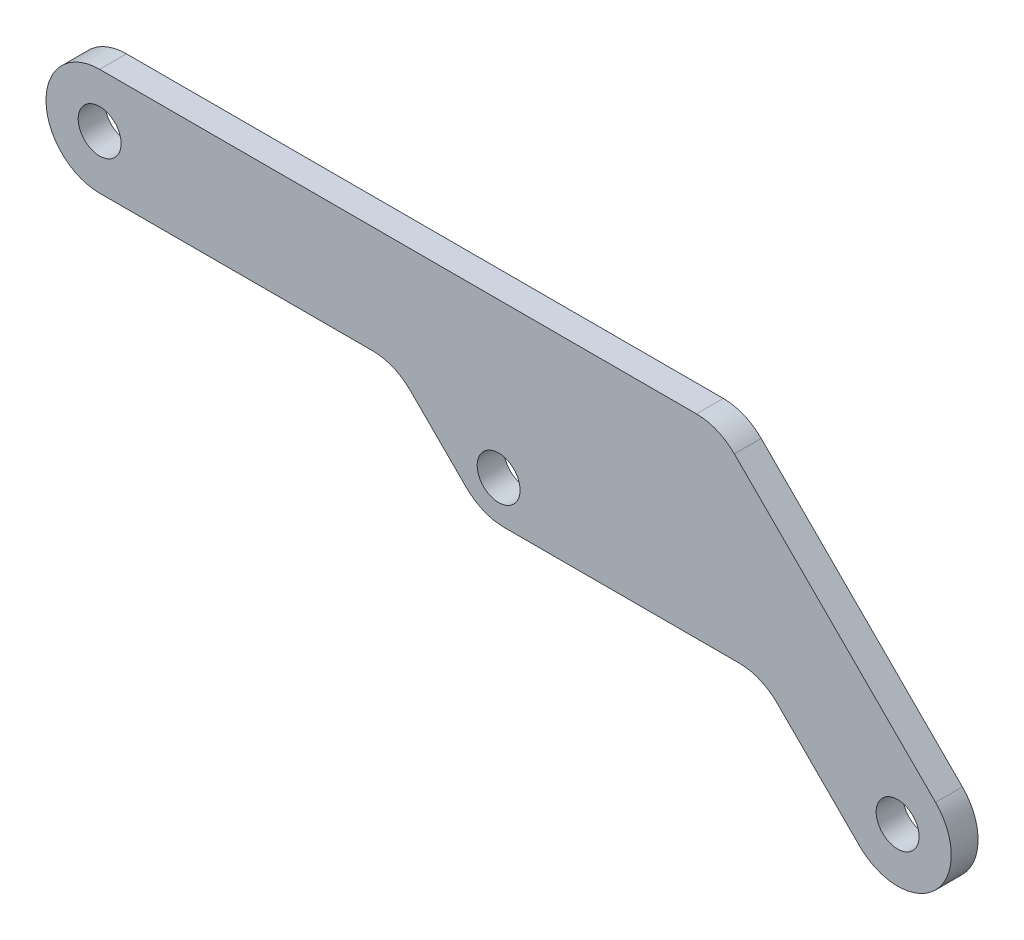
ISO-10303-21;
HEADER;
FILE_DESCRIPTION(('STEP AP214'),'2;1');
FILE_NAME('part.step','',(''),(''),'','','');
FILE_SCHEMA(('AUTOMOTIVE_DESIGN { 1 0 10303 214 1 1 1 1 }'));
ENDSEC;
DATA;
#1=APPLICATION_CONTEXT('core data for automotive mechanical design processes');
#2=APPLICATION_PROTOCOL_DEFINITION('international standard','automotive_design',2000,#1);
#3=PRODUCT_CONTEXT('',#1,'mechanical');
#4=PRODUCT('Part','Part','',(#3));
#5=PRODUCT_RELATED_PRODUCT_CATEGORY('part','',(#4));
#6=PRODUCT_DEFINITION_FORMATION('','',#4);
#7=PRODUCT_DEFINITION_CONTEXT('part definition',#1,'design');
#8=PRODUCT_DEFINITION('design','',#6,#7);
#9=PRODUCT_DEFINITION_SHAPE('','',#8);
#10=(LENGTH_UNIT() NAMED_UNIT(*) SI_UNIT(.MILLI.,.METRE.));
#11=(NAMED_UNIT(*) PLANE_ANGLE_UNIT() SI_UNIT($,.RADIAN.));
#12=(NAMED_UNIT(*) SI_UNIT($,.STERADIAN.) SOLID_ANGLE_UNIT());
#13=UNCERTAINTY_MEASURE_WITH_UNIT(LENGTH_MEASURE(1.E-05),#10,'distance_accuracy_value','');
#14=(GEOMETRIC_REPRESENTATION_CONTEXT(3) GLOBAL_UNCERTAINTY_ASSIGNED_CONTEXT((#13)) GLOBAL_UNIT_ASSIGNED_CONTEXT((#10,
#11,#12)) REPRESENTATION_CONTEXT('',''));
#15=CARTESIAN_POINT('',(0.,0.,0.));
#16=DIRECTION('',(0.,0.,1.));
#17=DIRECTION('',(1.,0.,0.));
#18=AXIS2_PLACEMENT_3D('',#15,#16,#17);
#19=CARTESIAN_POINT('',(-55.,-20.6,2.));
#20=DIRECTION('',(0.,0.,1.));
#21=DIRECTION('',(1.,0.,0.));
#22=AXIS2_PLACEMENT_3D('',#19,#20,#21);
#23=PLANE('',#22);
#24=CARTESIAN_POINT('',(4.5,-35.6000000000001,2.));
#25=DIRECTION('',(0.,0.,1.));
#26=DIRECTION('',(1.,0.,0.));
#27=AXIS2_PLACEMENT_3D('',#24,#25,#26);
#28=CIRCLE('',#27,1.6);
#29=CARTESIAN_POINT('',(6.09999999999999,-35.6000000000001,2.));
#30=VERTEX_POINT('',#29);
#31=EDGE_CURVE('E287',#30,#30,#28,.T.);
#32=ORIENTED_EDGE('',*,*,#31,.F.);
#33=EDGE_LOOP('',(#32));
#34=FACE_BOUND('',#33,.T.);
#35=DIRECTION('',(-0.707106781186547,0.707106781186548,0.));
#36=VECTOR('',#35,1.);
#37=CARTESIAN_POINT('',(7.32842712474618,-32.7715728752539,2.));
#38=LINE('',#37,#36);
#39=CARTESIAN_POINT('',(7.32842712474618,-32.7715728752539,2.));
#40=VERTEX_POINT('',#39);
#41=CARTESIAN_POINT('',(-7.6715728752538,-17.7715728752539,2.));
#42=VERTEX_POINT('',#41);
#43=EDGE_CURVE('E209',#40,#42,#38,.T.);
#44=ORIENTED_EDGE('',*,*,#43,.T.);
#45=CARTESIAN_POINT('',(-10.5,-20.6,2.));
#46=DIRECTION('',(0.,0.,1.));
#47=DIRECTION('',(1.,0.,0.));
#48=AXIS2_PLACEMENT_3D('',#45,#46,#47);
#49=CIRCLE('',#48,4.);
#50=CARTESIAN_POINT('',(-10.5,-16.6,2.));
#51=VERTEX_POINT('',#50);
#52=EDGE_CURVE('E167',#42,#51,#49,.T.);
#53=ORIENTED_EDGE('',*,*,#52,.T.);
#54=DIRECTION('',(-1.,0.,0.));
#55=VECTOR('',#54,1.);
#56=CARTESIAN_POINT('',(-55.,-16.6,2.));
#57=LINE('',#56,#55);
#58=CARTESIAN_POINT('',(-55.,-16.6,2.));
#59=VERTEX_POINT('',#58);
#60=EDGE_CURVE('E140',#51,#59,#57,.T.);
#61=ORIENTED_EDGE('',*,*,#60,.T.);
#62=CARTESIAN_POINT('',(-55.,-20.6,2.));
#63=DIRECTION('',(0.,0.,1.));
#64=DIRECTION('',(1.,0.,0.));
#65=AXIS2_PLACEMENT_3D('',#62,#63,#64);
#66=CIRCLE('',#65,4.);
#67=CARTESIAN_POINT('',(-55.,-24.6000000000001,2.));
#68=VERTEX_POINT('',#67);
#69=EDGE_CURVE('E134',#59,#68,#66,.T.);
#70=ORIENTED_EDGE('',*,*,#69,.T.);
#71=DIRECTION('',(1.,0.,0.));
#72=VECTOR('',#71,1.);
#73=CARTESIAN_POINT('',(-55.,-24.6000000000001,2.));
#74=LINE('',#73,#72);
#75=CARTESIAN_POINT('',(-34.6494949366117,-24.6000000000001,2.));
#76=VERTEX_POINT('',#75);
#77=EDGE_CURVE('E123',#68,#76,#74,.T.);
#78=ORIENTED_EDGE('',*,*,#77,.T.);
#79=CARTESIAN_POINT('',(-34.6494949366117,-28.6000000000001,2.));
#80=DIRECTION('',(0.,0.,1.));
#81=DIRECTION('',(1.,0.,0.));
#82=AXIS2_PLACEMENT_3D('',#79,#80,#81);
#83=CIRCLE('',#82,4.);
#84=CARTESIAN_POINT('',(-31.8210678118655,-25.7715728752539,2.));
#85=VERTEX_POINT('',#84);
#86=EDGE_CURVE('E11',#76,#85,#83,.F.);
#87=ORIENTED_EDGE('',*,*,#86,.T.);
#88=DIRECTION('',(0.707106781186547,-0.707106781186548,0.));
#89=VECTOR('',#88,1.);
#90=CARTESIAN_POINT('',(-32.9926406871193,-24.6000000000001,2.));
#91=LINE('',#90,#89);
#92=CARTESIAN_POINT('',(-27.6642135623731,-29.9284271247462,2.));
#93=VERTEX_POINT('',#92);
#94=EDGE_CURVE('E133',#85,#93,#91,.T.);
#95=ORIENTED_EDGE('',*,*,#94,.T.);
#96=CARTESIAN_POINT('',(-24.8357864376269,-27.1,2.));
#97=DIRECTION('',(0.,0.,1.));
#98=DIRECTION('',(1.,0.,0.));
#99=AXIS2_PLACEMENT_3D('',#96,#97,#98);
#100=CIRCLE('',#99,4.);
#101=CARTESIAN_POINT('',(-24.8357864376269,-31.1,2.));
#102=VERTEX_POINT('',#101);
#103=EDGE_CURVE('E165',#93,#102,#100,.T.);
#104=ORIENTED_EDGE('',*,*,#103,.T.);
#105=DIRECTION('',(1.,0.,0.));
#106=VECTOR('',#105,1.);
#107=CARTESIAN_POINT('',(-26.4926406871193,-31.1,2.));
#108=LINE('',#107,#106);
#109=CARTESIAN_POINT('',(-7.31370849898476,-31.1,2.));
#110=VERTEX_POINT('',#109);
#111=EDGE_CURVE('E201',#102,#110,#108,.T.);
#112=ORIENTED_EDGE('',*,*,#111,.T.);
#113=CARTESIAN_POINT('',(-7.31370849898476,-35.1000000000001,2.));
#114=DIRECTION('',(0.,0.,1.));
#115=DIRECTION('',(1.,0.,0.));
#116=AXIS2_PLACEMENT_3D('',#113,#114,#115);
#117=CIRCLE('',#116,4.);
#118=CARTESIAN_POINT('',(-4.48528137423857,-32.2715728752539,2.));
#119=VERTEX_POINT('',#118);
#120=EDGE_CURVE('E48',#110,#119,#117,.F.);
#121=ORIENTED_EDGE('',*,*,#120,.T.);
#122=DIRECTION('',(0.707106781186547,-0.707106781186548,0.));
#123=VECTOR('',#122,1.);
#124=CARTESIAN_POINT('',(-5.65685424949238,-31.1,2.));
#125=LINE('',#124,#123);
#126=CARTESIAN_POINT('',(1.67157287525381,-38.4284271247462,2.));
#127=VERTEX_POINT('',#126);
#128=EDGE_CURVE('E203',#119,#127,#125,.T.);
#129=ORIENTED_EDGE('',*,*,#128,.T.);
#130=CARTESIAN_POINT('',(4.5,-35.6000000000001,2.));
#131=DIRECTION('',(0.,0.,1.));
#132=DIRECTION('',(1.,0.,0.));
#133=AXIS2_PLACEMENT_3D('',#130,#131,#132);
#134=CIRCLE('',#133,3.99999999999999);
#135=EDGE_CURVE('E207',#127,#40,#134,.T.);
#136=ORIENTED_EDGE('',*,*,#135,.T.);
#137=EDGE_LOOP('',(#44,#53,#61,#70,#78,#87,#95,#104,#112,#121,#129,#136));
#138=FACE_BOUND('',#137,.T.);
#139=CARTESIAN_POINT('',(-25.25,-28.1,2.));
#140=DIRECTION('',(0.,0.,1.));
#141=DIRECTION('',(1.,0.,0.));
#142=AXIS2_PLACEMENT_3D('',#139,#140,#141);
#143=CIRCLE('',#142,1.6);
#144=CARTESIAN_POINT('',(-23.65,-28.1,2.));
#145=VERTEX_POINT('',#144);
#146=EDGE_CURVE('E213',#145,#145,#143,.T.);
#147=ORIENTED_EDGE('',*,*,#146,.F.);
#148=EDGE_LOOP('',(#147));
#149=FACE_BOUND('',#148,.T.);
#150=CARTESIAN_POINT('',(-55.,-20.6,2.));
#151=DIRECTION('',(0.,0.,1.));
#152=DIRECTION('',(1.,0.,0.));
#153=AXIS2_PLACEMENT_3D('',#150,#151,#152);
#154=CIRCLE('',#153,1.6);
#155=CARTESIAN_POINT('',(-53.4,-20.6,2.));
#156=VERTEX_POINT('',#155);
#157=EDGE_CURVE('E278',#156,#156,#154,.T.);
#158=ORIENTED_EDGE('',*,*,#157,.F.);
#159=EDGE_LOOP('',(#158));
#160=FACE_BOUND('',#159,.T.);
#161=ADVANCED_FACE('F33',(#34,#138,#149,#160),#23,.T.);
#162=CARTESIAN_POINT('',(-55.,-20.6,0.));
#163=DIRECTION('',(0.,0.,1.));
#164=DIRECTION('',(1.,0.,0.));
#165=AXIS2_PLACEMENT_3D('',#162,#163,#164);
#166=PLANE('',#165);
#167=DIRECTION('',(-1.,0.,0.));
#168=VECTOR('',#167,1.);
#169=CARTESIAN_POINT('',(-55.,-16.6,0.));
#170=LINE('',#169,#168);
#171=CARTESIAN_POINT('',(-10.5,-16.6,0.));
#172=VERTEX_POINT('',#171);
#173=CARTESIAN_POINT('',(-55.,-16.6,0.));
#174=VERTEX_POINT('',#173);
#175=EDGE_CURVE('E144',#172,#174,#170,.T.);
#176=ORIENTED_EDGE('',*,*,#175,.F.);
#177=CARTESIAN_POINT('',(-10.5,-20.6,0.));
#178=DIRECTION('',(0.,0.,1.));
#179=DIRECTION('',(1.,0.,0.));
#180=AXIS2_PLACEMENT_3D('',#177,#178,#179);
#181=CIRCLE('',#180,4.);
#182=CARTESIAN_POINT('',(-7.6715728752538,-17.7715728752539,0.));
#183=VERTEX_POINT('',#182);
#184=EDGE_CURVE('E161',#172,#183,#181,.F.);
#185=ORIENTED_EDGE('',*,*,#184,.T.);
#186=DIRECTION('',(-0.707106781186547,0.707106781186548,0.));
#187=VECTOR('',#186,1.);
#188=CARTESIAN_POINT('',(7.32842712474618,-32.7715728752539,0.));
#189=LINE('',#188,#187);
#190=CARTESIAN_POINT('',(7.32842712474618,-32.7715728752539,0.));
#191=VERTEX_POINT('',#190);
#192=EDGE_CURVE('E222',#191,#183,#189,.T.);
#193=ORIENTED_EDGE('',*,*,#192,.F.);
#194=CARTESIAN_POINT('',(4.5,-35.6000000000001,0.));
#195=DIRECTION('',(0.,0.,1.));
#196=DIRECTION('',(1.,0.,0.));
#197=AXIS2_PLACEMENT_3D('',#194,#195,#196);
#198=CIRCLE('',#197,3.99999999999999);
#199=CARTESIAN_POINT('',(1.67157287525381,-38.4284271247462,0.));
#200=VERTEX_POINT('',#199);
#201=EDGE_CURVE('E220',#200,#191,#198,.T.);
#202=ORIENTED_EDGE('',*,*,#201,.F.);
#203=DIRECTION('',(0.707106781186547,-0.707106781186548,0.));
#204=VECTOR('',#203,1.);
#205=CARTESIAN_POINT('',(-5.65685424949238,-31.1,0.));
#206=LINE('',#205,#204);
#207=CARTESIAN_POINT('',(-4.48528137423857,-32.2715728752539,0.));
#208=VERTEX_POINT('',#207);
#209=EDGE_CURVE('E218',#208,#200,#206,.T.);
#210=ORIENTED_EDGE('',*,*,#209,.F.);
#211=CARTESIAN_POINT('',(-7.31370849898476,-35.1000000000001,0.));
#212=DIRECTION('',(0.,0.,1.));
#213=DIRECTION('',(1.,0.,0.));
#214=AXIS2_PLACEMENT_3D('',#211,#212,#213);
#215=CIRCLE('',#214,4.);
#216=CARTESIAN_POINT('',(-7.31370849898476,-31.1,0.));
#217=VERTEX_POINT('',#216);
#218=EDGE_CURVE('E182',#208,#217,#215,.T.);
#219=ORIENTED_EDGE('',*,*,#218,.T.);
#220=DIRECTION('',(1.,0.,0.));
#221=VECTOR('',#220,1.);
#222=CARTESIAN_POINT('',(-26.4926406871193,-31.1,0.));
#223=LINE('',#222,#221);
#224=CARTESIAN_POINT('',(-24.8357864376269,-31.1,0.));
#225=VERTEX_POINT('',#224);
#226=EDGE_CURVE('E216',#225,#217,#223,.T.);
#227=ORIENTED_EDGE('',*,*,#226,.F.);
#228=CARTESIAN_POINT('',(-24.8357864376269,-27.1,0.));
#229=DIRECTION('',(0.,0.,1.));
#230=DIRECTION('',(1.,0.,0.));
#231=AXIS2_PLACEMENT_3D('',#228,#229,#230);
#232=CIRCLE('',#231,4.);
#233=CARTESIAN_POINT('',(-27.6642135623731,-29.9284271247462,0.));
#234=VERTEX_POINT('',#233);
#235=EDGE_CURVE('E153',#225,#234,#232,.F.);
#236=ORIENTED_EDGE('',*,*,#235,.T.);
#237=DIRECTION('',(0.707106781186547,-0.707106781186548,0.));
#238=VECTOR('',#237,1.);
#239=CARTESIAN_POINT('',(-32.9926406871193,-24.6000000000001,0.));
#240=LINE('',#239,#238);
#241=CARTESIAN_POINT('',(-31.8210678118655,-25.7715728752539,0.));
#242=VERTEX_POINT('',#241);
#243=EDGE_CURVE('E191',#242,#234,#240,.T.);
#244=ORIENTED_EDGE('',*,*,#243,.F.);
#245=CARTESIAN_POINT('',(-34.6494949366117,-28.6000000000001,0.));
#246=DIRECTION('',(0.,0.,1.));
#247=DIRECTION('',(1.,0.,0.));
#248=AXIS2_PLACEMENT_3D('',#245,#246,#247);
#249=CIRCLE('',#248,4.);
#250=CARTESIAN_POINT('',(-34.6494949366117,-24.6000000000001,0.));
#251=VERTEX_POINT('',#250);
#252=EDGE_CURVE('E41',#242,#251,#249,.T.);
#253=ORIENTED_EDGE('',*,*,#252,.T.);
#254=DIRECTION('',(1.,0.,0.));
#255=VECTOR('',#254,1.);
#256=CARTESIAN_POINT('',(-55.,-24.6000000000001,0.));
#257=LINE('',#256,#255);
#258=CARTESIAN_POINT('',(-55.,-24.6000000000001,0.));
#259=VERTEX_POINT('',#258);
#260=EDGE_CURVE('E189',#259,#251,#257,.T.);
#261=ORIENTED_EDGE('',*,*,#260,.F.);
#262=CARTESIAN_POINT('',(-55.,-20.6,0.));
#263=DIRECTION('',(0.,0.,1.));
#264=DIRECTION('',(1.,0.,0.));
#265=AXIS2_PLACEMENT_3D('',#262,#263,#264);
#266=CIRCLE('',#265,4.);
#267=EDGE_CURVE('E148',#174,#259,#266,.T.);
#268=ORIENTED_EDGE('',*,*,#267,.F.);
#269=EDGE_LOOP('',(#176,#185,#193,#202,#210,#219,#227,#236,#244,#253,#261,#268));
#270=FACE_BOUND('',#269,.T.);
#271=CARTESIAN_POINT('',(-25.25,-28.1,0.));
#272=DIRECTION('',(0.,0.,1.));
#273=DIRECTION('',(1.,0.,0.));
#274=AXIS2_PLACEMENT_3D('',#271,#272,#273);
#275=CIRCLE('',#274,1.6);
#276=CARTESIAN_POINT('',(-23.65,-28.1,0.));
#277=VERTEX_POINT('',#276);
#278=EDGE_CURVE('E290',#277,#277,#275,.T.);
#279=ORIENTED_EDGE('',*,*,#278,.T.);
#280=EDGE_LOOP('',(#279));
#281=FACE_BOUND('',#280,.T.);
#282=CARTESIAN_POINT('',(4.5,-35.6000000000001,0.));
#283=DIRECTION('',(0.,0.,1.));
#284=DIRECTION('',(1.,0.,0.));
#285=AXIS2_PLACEMENT_3D('',#282,#283,#284);
#286=CIRCLE('',#285,1.6);
#287=CARTESIAN_POINT('',(6.09999999999999,-35.6000000000001,0.));
#288=VERTEX_POINT('',#287);
#289=EDGE_CURVE('E284',#288,#288,#286,.T.);
#290=ORIENTED_EDGE('',*,*,#289,.T.);
#291=EDGE_LOOP('',(#290));
#292=FACE_BOUND('',#291,.T.);
#293=CARTESIAN_POINT('',(-55.,-20.6,0.));
#294=DIRECTION('',(0.,0.,1.));
#295=DIRECTION('',(1.,0.,0.));
#296=AXIS2_PLACEMENT_3D('',#293,#294,#295);
#297=CIRCLE('',#296,1.6);
#298=CARTESIAN_POINT('',(-53.4,-20.6,0.));
#299=VERTEX_POINT('',#298);
#300=EDGE_CURVE('E281',#299,#299,#297,.T.);
#301=ORIENTED_EDGE('',*,*,#300,.T.);
#302=EDGE_LOOP('',(#301));
#303=FACE_BOUND('',#302,.T.);
#304=ADVANCED_FACE('F187',(#270,#281,#292,#303),#166,.F.);
#305=CARTESIAN_POINT('',(-55.,-20.6,2.));
#306=DIRECTION('',(0.,0.,-1.));
#307=DIRECTION('',(-1.,0.,0.));
#308=AXIS2_PLACEMENT_3D('',#305,#306,#307);
#309=CYLINDRICAL_SURFACE('',#308,4.);
#310=ORIENTED_EDGE('',*,*,#267,.T.);
#311=DIRECTION('',(0.,0.,-1.));
#312=VECTOR('',#311,1.);
#313=CARTESIAN_POINT('',(-55.,-24.6000000000001,2.));
#314=LINE('',#313,#312);
#315=EDGE_CURVE('E128',#68,#259,#314,.T.);
#316=ORIENTED_EDGE('',*,*,#315,.F.);
#317=ORIENTED_EDGE('',*,*,#69,.F.);
#318=DIRECTION('',(0.,0.,-1.));
#319=VECTOR('',#318,1.);
#320=CARTESIAN_POINT('',(-55.,-16.6,2.));
#321=LINE('',#320,#319);
#322=EDGE_CURVE('E212',#59,#174,#321,.T.);
#323=ORIENTED_EDGE('',*,*,#322,.T.);
#324=EDGE_LOOP('',(#310,#316,#317,#323));
#325=FACE_BOUND('',#324,.T.);
#326=ADVANCED_FACE('F146',(#325),#309,.T.);
#327=CARTESIAN_POINT('',(-55.,-24.6000000000001,2.));
#328=DIRECTION('',(0.,1.,0.));
#329=DIRECTION('',(-1.,0.,0.));
#330=AXIS2_PLACEMENT_3D('',#327,#328,#329);
#331=PLANE('',#330);
#332=ORIENTED_EDGE('',*,*,#260,.T.);
#333=DIRECTION('',(0.,0.,-1.));
#334=VECTOR('',#333,1.);
#335=CARTESIAN_POINT('',(-34.6494949366117,-24.6000000000001,2.));
#336=LINE('',#335,#334);
#337=EDGE_CURVE('E131',#251,#76,#336,.F.);
#338=ORIENTED_EDGE('',*,*,#337,.T.);
#339=ORIENTED_EDGE('',*,*,#77,.F.);
#340=ORIENTED_EDGE('',*,*,#315,.T.);
#341=EDGE_LOOP('',(#332,#338,#339,#340));
#342=FACE_BOUND('',#341,.T.);
#343=ADVANCED_FACE('F126',(#342),#331,.F.);
#344=CARTESIAN_POINT('',(-32.9926406871193,-24.6000000000001,2.));
#345=DIRECTION('',(0.707106781186548,0.707106781186547,0.));
#346=DIRECTION('',(-0.707106781186547,0.707106781186548,0.));
#347=AXIS2_PLACEMENT_3D('',#344,#345,#346);
#348=PLANE('',#347);
#349=ORIENTED_EDGE('',*,*,#243,.T.);
#350=DIRECTION('',(0.,0.,-1.));
#351=VECTOR('',#350,1.);
#352=CARTESIAN_POINT('',(-27.6642135623731,-29.9284271247462,2.));
#353=LINE('',#352,#351);
#354=EDGE_CURVE('E179',#234,#93,#353,.F.);
#355=ORIENTED_EDGE('',*,*,#354,.T.);
#356=ORIENTED_EDGE('',*,*,#94,.F.);
#357=DIRECTION('',(0.,0.,-1.));
#358=VECTOR('',#357,1.);
#359=CARTESIAN_POINT('',(-31.8210678118655,-25.7715728752539,0.));
#360=LINE('',#359,#358);
#361=EDGE_CURVE('E176',#85,#242,#360,.T.);
#362=ORIENTED_EDGE('',*,*,#361,.T.);
#363=EDGE_LOOP('',(#349,#355,#356,#362));
#364=FACE_BOUND('',#363,.T.);
#365=ADVANCED_FACE('F199',(#364),#348,.F.);
#366=CARTESIAN_POINT('',(-26.4926406871193,-31.1,2.));
#367=DIRECTION('',(0.,1.,0.));
#368=DIRECTION('',(0.,0.,1.));
#369=AXIS2_PLACEMENT_3D('',#366,#367,#368);
#370=PLANE('',#369);
#371=ORIENTED_EDGE('',*,*,#226,.T.);
#372=DIRECTION('',(0.,0.,-1.));
#373=VECTOR('',#372,1.);
#374=CARTESIAN_POINT('',(-7.31370849898476,-31.1,2.));
#375=LINE('',#374,#373);
#376=EDGE_CURVE('E56',#217,#110,#375,.F.);
#377=ORIENTED_EDGE('',*,*,#376,.T.);
#378=ORIENTED_EDGE('',*,*,#111,.F.);
#379=DIRECTION('',(0.,0.,-1.));
#380=VECTOR('',#379,1.);
#381=CARTESIAN_POINT('',(-24.8357864376269,-31.1,2.));
#382=LINE('',#381,#380);
#383=EDGE_CURVE('E172',#102,#225,#382,.T.);
#384=ORIENTED_EDGE('',*,*,#383,.T.);
#385=EDGE_LOOP('',(#371,#377,#378,#384));
#386=FACE_BOUND('',#385,.T.);
#387=ADVANCED_FACE('F317',(#386),#370,.F.);
#388=CARTESIAN_POINT('',(-5.65685424949238,-31.1,2.));
#389=DIRECTION('',(0.707106781186548,0.707106781186547,0.));
#390=DIRECTION('',(-0.707106781186547,0.707106781186548,0.));
#391=AXIS2_PLACEMENT_3D('',#388,#389,#390);
#392=PLANE('',#391);
#393=ORIENTED_EDGE('',*,*,#128,.F.);
#394=DIRECTION('',(0.,0.,-1.));
#395=VECTOR('',#394,1.);
#396=CARTESIAN_POINT('',(-4.48528137423857,-32.2715728752539,0.));
#397=LINE('',#396,#395);
#398=EDGE_CURVE('E169',#119,#208,#397,.T.);
#399=ORIENTED_EDGE('',*,*,#398,.T.);
#400=ORIENTED_EDGE('',*,*,#209,.T.);
#401=DIRECTION('',(0.,0.,-1.));
#402=VECTOR('',#401,1.);
#403=CARTESIAN_POINT('',(1.67157287525381,-38.4284271247462,2.));
#404=LINE('',#403,#402);
#405=EDGE_CURVE('E150',#127,#200,#404,.T.);
#406=ORIENTED_EDGE('',*,*,#405,.F.);
#407=EDGE_LOOP('',(#393,#399,#400,#406));
#408=FACE_BOUND('',#407,.T.);
#409=ADVANCED_FACE('F321',(#408),#392,.F.);
#410=CARTESIAN_POINT('',(4.5,-35.6000000000001,2.));
#411=DIRECTION('',(0.,0.,-1.));
#412=DIRECTION('',(-1.,0.,0.));
#413=AXIS2_PLACEMENT_3D('',#410,#411,#412);
#414=CYLINDRICAL_SURFACE('',#413,3.99999999999999);
#415=ORIENTED_EDGE('',*,*,#201,.T.);
#416=DIRECTION('',(0.,0.,-1.));
#417=VECTOR('',#416,1.);
#418=CARTESIAN_POINT('',(7.32842712474618,-32.7715728752539,2.));
#419=LINE('',#418,#417);
#420=EDGE_CURVE('E156',#40,#191,#419,.T.);
#421=ORIENTED_EDGE('',*,*,#420,.F.);
#422=ORIENTED_EDGE('',*,*,#135,.F.);
#423=ORIENTED_EDGE('',*,*,#405,.T.);
#424=EDGE_LOOP('',(#415,#421,#422,#423));
#425=FACE_BOUND('',#424,.T.);
#426=ADVANCED_FACE('F253',(#425),#414,.T.);
#427=CARTESIAN_POINT('',(7.32842712474618,-32.7715728752539,2.));
#428=DIRECTION('',(-0.707106781186549,-0.707106781186547,0.));
#429=DIRECTION('',(0.707106781186547,-0.707106781186549,0.));
#430=AXIS2_PLACEMENT_3D('',#427,#428,#429);
#431=PLANE('',#430);
#432=ORIENTED_EDGE('',*,*,#192,.T.);
#433=DIRECTION('',(0.,0.,-1.));
#434=VECTOR('',#433,1.);
#435=CARTESIAN_POINT('',(-7.6715728752538,-17.7715728752539,2.));
#436=LINE('',#435,#434);
#437=EDGE_CURVE('E163',#183,#42,#436,.F.);
#438=ORIENTED_EDGE('',*,*,#437,.T.);
#439=ORIENTED_EDGE('',*,*,#43,.F.);
#440=ORIENTED_EDGE('',*,*,#420,.T.);
#441=EDGE_LOOP('',(#432,#438,#439,#440));
#442=FACE_BOUND('',#441,.T.);
#443=ADVANCED_FACE('F231',(#442),#431,.F.);
#444=CARTESIAN_POINT('',(-55.,-16.6,2.));
#445=DIRECTION('',(0.,-1.,0.));
#446=DIRECTION('',(0.,0.,-1.));
#447=AXIS2_PLACEMENT_3D('',#444,#445,#446);
#448=PLANE('',#447);
#449=ORIENTED_EDGE('',*,*,#60,.F.);
#450=DIRECTION('',(0.,0.,-1.));
#451=VECTOR('',#450,1.);
#452=CARTESIAN_POINT('',(-10.5,-16.6,2.));
#453=LINE('',#452,#451);
#454=EDGE_CURVE('E149',#51,#172,#453,.T.);
#455=ORIENTED_EDGE('',*,*,#454,.T.);
#456=ORIENTED_EDGE('',*,*,#175,.T.);
#457=ORIENTED_EDGE('',*,*,#322,.F.);
#458=EDGE_LOOP('',(#449,#455,#456,#457));
#459=FACE_BOUND('',#458,.T.);
#460=ADVANCED_FACE('F242',(#459),#448,.F.);
#461=CARTESIAN_POINT('',(-25.25,-28.1,2.));
#462=DIRECTION('',(0.,0.,-1.));
#463=DIRECTION('',(-1.,0.,0.));
#464=AXIS2_PLACEMENT_3D('',#461,#462,#463);
#465=CYLINDRICAL_SURFACE('',#464,1.6);
#466=ORIENTED_EDGE('',*,*,#146,.T.);
#467=EDGE_LOOP('',(#466));
#468=FACE_BOUND('',#467,.T.);
#469=ORIENTED_EDGE('',*,*,#278,.F.);
#470=EDGE_LOOP('',(#469));
#471=FACE_BOUND('',#470,.T.);
#472=ADVANCED_FACE('F244',(#468,#471),#465,.F.);
#473=CARTESIAN_POINT('',(4.5,-35.6000000000001,2.));
#474=DIRECTION('',(0.,0.,-1.));
#475=DIRECTION('',(-1.,0.,0.));
#476=AXIS2_PLACEMENT_3D('',#473,#474,#475);
#477=CYLINDRICAL_SURFACE('',#476,1.6);
#478=ORIENTED_EDGE('',*,*,#31,.T.);
#479=EDGE_LOOP('',(#478));
#480=FACE_BOUND('',#479,.T.);
#481=ORIENTED_EDGE('',*,*,#289,.F.);
#482=EDGE_LOOP('',(#481));
#483=FACE_BOUND('',#482,.T.);
#484=ADVANCED_FACE('F250',(#480,#483),#477,.F.);
#485=CARTESIAN_POINT('',(-55.,-20.6,2.));
#486=DIRECTION('',(0.,0.,-1.));
#487=DIRECTION('',(-1.,0.,0.));
#488=AXIS2_PLACEMENT_3D('',#485,#486,#487);
#489=CYLINDRICAL_SURFACE('',#488,1.6);
#490=ORIENTED_EDGE('',*,*,#157,.T.);
#491=EDGE_LOOP('',(#490));
#492=FACE_BOUND('',#491,.T.);
#493=ORIENTED_EDGE('',*,*,#300,.F.);
#494=EDGE_LOOP('',(#493));
#495=FACE_BOUND('',#494,.T.);
#496=ADVANCED_FACE('F266',(#492,#495),#489,.F.);
#497=CARTESIAN_POINT('',(-10.5,-20.6,2.));
#498=DIRECTION('',(0.,0.,-1.));
#499=DIRECTION('',(-1.,0.,0.));
#500=AXIS2_PLACEMENT_3D('',#497,#498,#499);
#501=CYLINDRICAL_SURFACE('',#500,4.);
#502=ORIENTED_EDGE('',*,*,#52,.F.);
#503=ORIENTED_EDGE('',*,*,#437,.F.);
#504=ORIENTED_EDGE('',*,*,#184,.F.);
#505=ORIENTED_EDGE('',*,*,#454,.F.);
#506=EDGE_LOOP('',(#502,#503,#504,#505));
#507=FACE_BOUND('',#506,.T.);
#508=ADVANCED_FACE('F240',(#507),#501,.T.);
#509=CARTESIAN_POINT('',(-7.31370849898476,-35.1000000000001,2.));
#510=DIRECTION('',(0.,0.,1.));
#511=DIRECTION('',(1.,0.,0.));
#512=AXIS2_PLACEMENT_3D('',#509,#510,#511);
#513=CYLINDRICAL_SURFACE('',#512,4.);
#514=ORIENTED_EDGE('',*,*,#120,.F.);
#515=ORIENTED_EDGE('',*,*,#376,.F.);
#516=ORIENTED_EDGE('',*,*,#218,.F.);
#517=ORIENTED_EDGE('',*,*,#398,.F.);
#518=EDGE_LOOP('',(#514,#515,#516,#517));
#519=FACE_BOUND('',#518,.T.);
#520=ADVANCED_FACE('F273',(#519),#513,.F.);
#521=CARTESIAN_POINT('',(-24.8357864376269,-27.1,2.));
#522=DIRECTION('',(0.,0.,-1.));
#523=DIRECTION('',(-1.,0.,0.));
#524=AXIS2_PLACEMENT_3D('',#521,#522,#523);
#525=CYLINDRICAL_SURFACE('',#524,4.);
#526=ORIENTED_EDGE('',*,*,#103,.F.);
#527=ORIENTED_EDGE('',*,*,#354,.F.);
#528=ORIENTED_EDGE('',*,*,#235,.F.);
#529=ORIENTED_EDGE('',*,*,#383,.F.);
#530=EDGE_LOOP('',(#526,#527,#528,#529));
#531=FACE_BOUND('',#530,.T.);
#532=ADVANCED_FACE('F306',(#531),#525,.T.);
#533=CARTESIAN_POINT('',(-34.6494949366117,-28.6000000000001,2.));
#534=DIRECTION('',(0.,0.,1.));
#535=DIRECTION('',(1.,0.,0.));
#536=AXIS2_PLACEMENT_3D('',#533,#534,#535);
#537=CYLINDRICAL_SURFACE('',#536,4.);
#538=ORIENTED_EDGE('',*,*,#86,.F.);
#539=ORIENTED_EDGE('',*,*,#337,.F.);
#540=ORIENTED_EDGE('',*,*,#252,.F.);
#541=ORIENTED_EDGE('',*,*,#361,.F.);
#542=EDGE_LOOP('',(#538,#539,#540,#541));
#543=FACE_BOUND('',#542,.T.);
#544=ADVANCED_FACE('F35',(#543),#537,.F.);
#545=CLOSED_SHELL('',(#161,#304,#326,#343,#365,#387,#409,#426,#443,#460,#472,#484,#496,#508,
#520,#532,#544));
#546=MANIFOLD_SOLID_BREP('B2',#545);
#547=ADVANCED_BREP_SHAPE_REPRESENTATION('',(#18,#546),#14);
#548=SHAPE_DEFINITION_REPRESENTATION(#9,#547);
ENDSEC;
END-ISO-10303-21;
